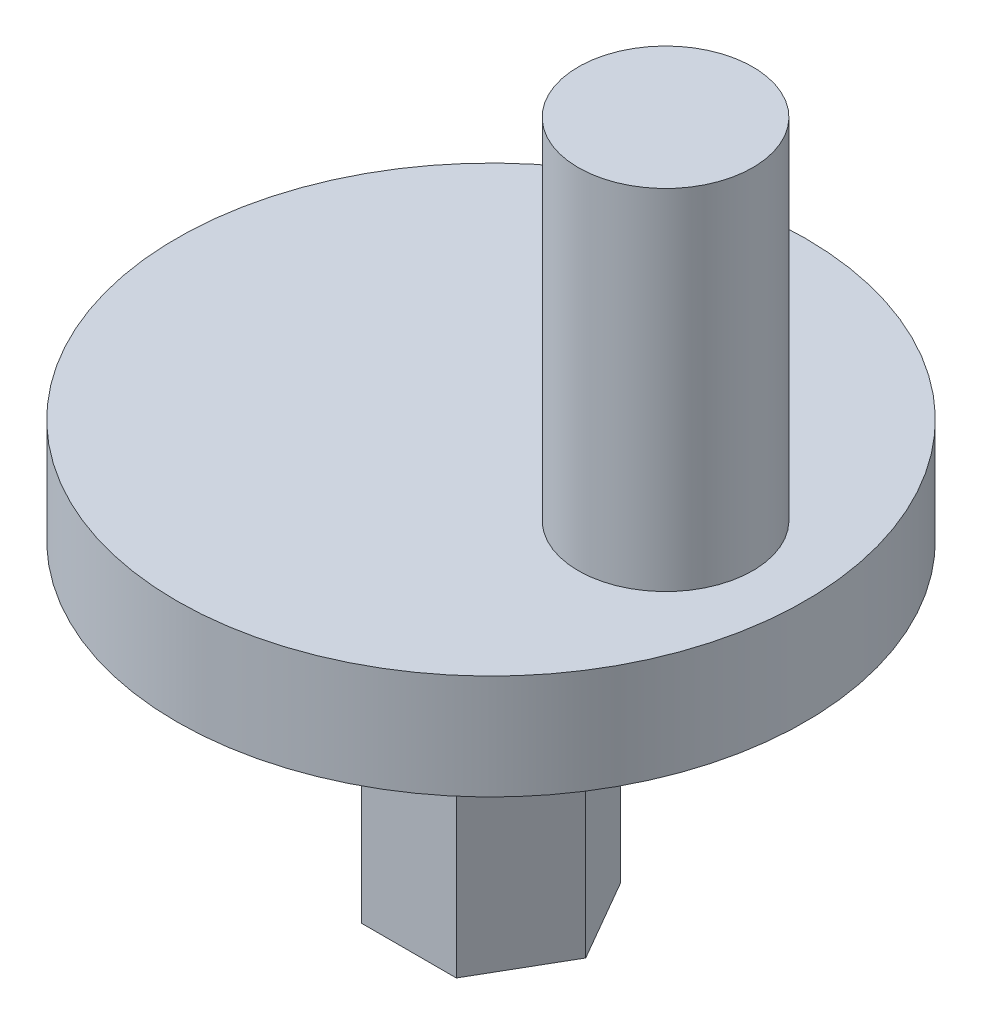
ISO-10303-21;
HEADER;
FILE_DESCRIPTION(('STEP AP214'),'2;1');
FILE_NAME('part.step','',(''),(''),'','','');
FILE_SCHEMA(('AUTOMOTIVE_DESIGN { 1 0 10303 214 1 1 1 1 }'));
ENDSEC;
DATA;
#1=APPLICATION_CONTEXT('core data for automotive mechanical design processes');
#2=APPLICATION_PROTOCOL_DEFINITION('international standard','automotive_design',2000,#1);
#3=PRODUCT_CONTEXT('',#1,'mechanical');
#4=PRODUCT('Part','Part','',(#3));
#5=PRODUCT_RELATED_PRODUCT_CATEGORY('part','',(#4));
#6=PRODUCT_DEFINITION_FORMATION('','',#4);
#7=PRODUCT_DEFINITION_CONTEXT('part definition',#1,'design');
#8=PRODUCT_DEFINITION('design','',#6,#7);
#9=PRODUCT_DEFINITION_SHAPE('','',#8);
#10=(LENGTH_UNIT() NAMED_UNIT(*) SI_UNIT(.MILLI.,.METRE.));
#11=(NAMED_UNIT(*) PLANE_ANGLE_UNIT() SI_UNIT($,.RADIAN.));
#12=(NAMED_UNIT(*) SI_UNIT($,.STERADIAN.) SOLID_ANGLE_UNIT());
#13=UNCERTAINTY_MEASURE_WITH_UNIT(LENGTH_MEASURE(1.E-05),#10,'distance_accuracy_value','');
#14=(GEOMETRIC_REPRESENTATION_CONTEXT(3) GLOBAL_UNCERTAINTY_ASSIGNED_CONTEXT((#13)) GLOBAL_UNIT_ASSIGNED_CONTEXT((#10,
#11,#12)) REPRESENTATION_CONTEXT('',''));
#15=CARTESIAN_POINT('',(0.,0.,0.));
#16=DIRECTION('',(0.,0.,1.));
#17=DIRECTION('',(1.,0.,0.));
#18=AXIS2_PLACEMENT_3D('',#15,#16,#17);
#19=CARTESIAN_POINT('',(0.,0.,0.));
#20=DIRECTION('',(0.,1.,0.));
#21=DIRECTION('',(0.,0.,1.));
#22=AXIS2_PLACEMENT_3D('',#19,#20,#21);
#23=PLANE('',#22);
#24=CARTESIAN_POINT('',(0.,0.,0.));
#25=DIRECTION('',(0.,1.,0.));
#26=DIRECTION('',(0.,0.,1.));
#27=AXIS2_PLACEMENT_3D('',#24,#25,#26);
#28=CIRCLE('',#27,9.);
#29=CARTESIAN_POINT('',(0.,0.,9.));
#30=VERTEX_POINT('',#29);
#31=EDGE_CURVE('E49',#30,#30,#28,.T.);
#32=ORIENTED_EDGE('',*,*,#31,.F.);
#33=EDGE_LOOP('',(#32));
#34=FACE_BOUND('',#33,.T.);
#35=DIRECTION('',(0.5,0.,0.866025403784439));
#36=VECTOR('',#35,1.);
#37=CARTESIAN_POINT('',(1.35677313259562,0.,-2.35));
#38=LINE('',#37,#36);
#39=CARTESIAN_POINT('',(1.35677313259562,0.,-2.35));
#40=VERTEX_POINT('',#39);
#41=CARTESIAN_POINT('',(2.71354626519124,0.,0.));
#42=VERTEX_POINT('',#41);
#43=EDGE_CURVE('E61',#40,#42,#38,.T.);
#44=ORIENTED_EDGE('',*,*,#43,.F.);
#45=DIRECTION('',(1.,0.,0.));
#46=VECTOR('',#45,1.);
#47=CARTESIAN_POINT('',(-1.35677313259562,0.,-2.35));
#48=LINE('',#47,#46);
#49=CARTESIAN_POINT('',(-1.35677313259562,0.,-2.35));
#50=VERTEX_POINT('',#49);
#51=EDGE_CURVE('E65',#50,#40,#48,.T.);
#52=ORIENTED_EDGE('',*,*,#51,.F.);
#53=DIRECTION('',(0.5,0.,-0.866025403784439));
#54=VECTOR('',#53,1.);
#55=CARTESIAN_POINT('',(-2.71354626519124,0.,0.));
#56=LINE('',#55,#54);
#57=CARTESIAN_POINT('',(-2.71354626519124,0.,0.));
#58=VERTEX_POINT('',#57);
#59=EDGE_CURVE('E255',#58,#50,#56,.T.);
#60=ORIENTED_EDGE('',*,*,#59,.F.);
#61=DIRECTION('',(-0.5,0.,-0.866025403784439));
#62=VECTOR('',#61,1.);
#63=CARTESIAN_POINT('',(-1.35677313259562,0.,2.35));
#64=LINE('',#63,#62);
#65=CARTESIAN_POINT('',(-1.35677313259562,0.,2.35));
#66=VERTEX_POINT('',#65);
#67=EDGE_CURVE('E275',#66,#58,#64,.T.);
#68=ORIENTED_EDGE('',*,*,#67,.F.);
#69=DIRECTION('',(-1.,0.,0.));
#70=VECTOR('',#69,1.);
#71=CARTESIAN_POINT('',(1.35677313259562,0.,2.35));
#72=LINE('',#71,#70);
#73=CARTESIAN_POINT('',(1.35677313259562,0.,2.35));
#74=VERTEX_POINT('',#73);
#75=EDGE_CURVE('E278',#74,#66,#72,.T.);
#76=ORIENTED_EDGE('',*,*,#75,.F.);
#77=DIRECTION('',(-0.5,0.,0.866025403784438));
#78=VECTOR('',#77,1.);
#79=CARTESIAN_POINT('',(2.71354626519124,0.,0.));
#80=LINE('',#79,#78);
#81=EDGE_CURVE('E280',#42,#74,#80,.T.);
#82=ORIENTED_EDGE('',*,*,#81,.F.);
#83=EDGE_LOOP('',(#44,#52,#60,#68,#76,#82));
#84=FACE_BOUND('',#83,.T.);
#85=ADVANCED_FACE('F45',(#34,#84),#23,.F.);
#86=CARTESIAN_POINT('',(0.,3.,0.));
#87=DIRECTION('',(0.,-1.,0.));
#88=DIRECTION('',(0.,0.,-1.));
#89=AXIS2_PLACEMENT_3D('',#86,#87,#88);
#90=CYLINDRICAL_SURFACE('',#89,9.);
#91=CARTESIAN_POINT('',(0.,3.,0.));
#92=DIRECTION('',(0.,1.,0.));
#93=DIRECTION('',(0.,0.,1.));
#94=AXIS2_PLACEMENT_3D('',#91,#92,#93);
#95=CIRCLE('',#94,9.);
#96=CARTESIAN_POINT('',(0.,3.,9.));
#97=VERTEX_POINT('',#96);
#98=EDGE_CURVE('E11',#97,#97,#95,.T.);
#99=ORIENTED_EDGE('',*,*,#98,.F.);
#100=EDGE_LOOP('',(#99));
#101=FACE_BOUND('',#100,.T.);
#102=ORIENTED_EDGE('',*,*,#31,.T.);
#103=EDGE_LOOP('',(#102));
#104=FACE_BOUND('',#103,.T.);
#105=ADVANCED_FACE('F47',(#101,#104),#90,.T.);
#106=CARTESIAN_POINT('',(0.,3.,0.));
#107=DIRECTION('',(0.,1.,0.));
#108=DIRECTION('',(0.,0.,1.));
#109=AXIS2_PLACEMENT_3D('',#106,#107,#108);
#110=PLANE('',#109);
#111=CARTESIAN_POINT('',(5.,3.,0.));
#112=DIRECTION('',(0.,1.,0.));
#113=DIRECTION('',(0.,0.,1.));
#114=AXIS2_PLACEMENT_3D('',#111,#112,#113);
#115=CIRCLE('',#114,2.5);
#116=CARTESIAN_POINT('',(5.,3.,2.5));
#117=VERTEX_POINT('',#116);
#118=EDGE_CURVE('E122',#117,#117,#115,.T.);
#119=ORIENTED_EDGE('',*,*,#118,.F.);
#120=EDGE_LOOP('',(#119));
#121=FACE_BOUND('',#120,.T.);
#122=ORIENTED_EDGE('',*,*,#98,.T.);
#123=EDGE_LOOP('',(#122));
#124=FACE_BOUND('',#123,.T.);
#125=ADVANCED_FACE('F148',(#121,#124),#110,.T.);
#126=CARTESIAN_POINT('',(5.,13.,0.));
#127=DIRECTION('',(0.,-1.,0.));
#128=DIRECTION('',(0.,0.,-1.));
#129=AXIS2_PLACEMENT_3D('',#126,#127,#128);
#130=CYLINDRICAL_SURFACE('',#129,2.5);
#131=CARTESIAN_POINT('',(5.,13.,0.));
#132=DIRECTION('',(0.,1.,0.));
#133=DIRECTION('',(0.,0.,1.));
#134=AXIS2_PLACEMENT_3D('',#131,#132,#133);
#135=CIRCLE('',#134,2.5);
#136=CARTESIAN_POINT('',(5.,13.,2.5));
#137=VERTEX_POINT('',#136);
#138=EDGE_CURVE('E127',#137,#137,#135,.T.);
#139=ORIENTED_EDGE('',*,*,#138,.F.);
#140=EDGE_LOOP('',(#139));
#141=FACE_BOUND('',#140,.T.);
#142=ORIENTED_EDGE('',*,*,#118,.T.);
#143=EDGE_LOOP('',(#142));
#144=FACE_BOUND('',#143,.T.);
#145=ADVANCED_FACE('F153',(#141,#144),#130,.T.);
#146=CARTESIAN_POINT('',(5.,13.,0.));
#147=DIRECTION('',(0.,1.,0.));
#148=DIRECTION('',(0.,0.,1.));
#149=AXIS2_PLACEMENT_3D('',#146,#147,#148);
#150=PLANE('',#149);
#151=ORIENTED_EDGE('',*,*,#138,.T.);
#152=EDGE_LOOP('',(#151));
#153=FACE_BOUND('',#152,.T.);
#154=ADVANCED_FACE('F157',(#153),#150,.T.);
#155=CARTESIAN_POINT('',(1.35677313259562,-9.,-2.35));
#156=DIRECTION('',(-0.866025403784439,0.,0.5));
#157=DIRECTION('',(0.5,0.,0.866025403784439));
#158=AXIS2_PLACEMENT_3D('',#155,#156,#157);
#159=PLANE('',#158);
#160=ORIENTED_EDGE('',*,*,#43,.T.);
#161=DIRECTION('',(0.,1.,0.));
#162=VECTOR('',#161,1.);
#163=CARTESIAN_POINT('',(2.71354626519124,-9.,0.));
#164=LINE('',#163,#162);
#165=CARTESIAN_POINT('',(2.71354626519124,-9.,0.));
#166=VERTEX_POINT('',#165);
#167=EDGE_CURVE('E102',#166,#42,#164,.T.);
#168=ORIENTED_EDGE('',*,*,#167,.F.);
#169=DIRECTION('',(0.5,0.,0.866025403784439));
#170=VECTOR('',#169,1.);
#171=CARTESIAN_POINT('',(1.35677313259562,-9.,-2.35));
#172=LINE('',#171,#170);
#173=CARTESIAN_POINT('',(1.35677313259562,-9.,-2.35));
#174=VERTEX_POINT('',#173);
#175=EDGE_CURVE('E109',#174,#166,#172,.T.);
#176=ORIENTED_EDGE('',*,*,#175,.F.);
#177=DIRECTION('',(0.,1.,0.));
#178=VECTOR('',#177,1.);
#179=CARTESIAN_POINT('',(1.35677313259562,-9.,-2.35));
#180=LINE('',#179,#178);
#181=EDGE_CURVE('E251',#174,#40,#180,.T.);
#182=ORIENTED_EDGE('',*,*,#181,.T.);
#183=EDGE_LOOP('',(#160,#168,#176,#182));
#184=FACE_BOUND('',#183,.T.);
#185=ADVANCED_FACE('F120',(#184),#159,.F.);
#186=CARTESIAN_POINT('',(2.71354626519124,-9.,0.));
#187=DIRECTION('',(-0.866025403784439,0.,-0.5));
#188=DIRECTION('',(-0.5,0.,0.866025403784439));
#189=AXIS2_PLACEMENT_3D('',#186,#187,#188);
#190=PLANE('',#189);
#191=ORIENTED_EDGE('',*,*,#81,.T.);
#192=DIRECTION('',(0.,1.,0.));
#193=VECTOR('',#192,1.);
#194=CARTESIAN_POINT('',(1.35677313259562,-9.,2.35));
#195=LINE('',#194,#193);
#196=CARTESIAN_POINT('',(1.35677313259562,-9.,2.35));
#197=VERTEX_POINT('',#196);
#198=EDGE_CURVE('E104',#197,#74,#195,.T.);
#199=ORIENTED_EDGE('',*,*,#198,.F.);
#200=DIRECTION('',(-0.5,0.,0.866025403784438));
#201=VECTOR('',#200,1.);
#202=CARTESIAN_POINT('',(2.71354626519124,-9.,0.));
#203=LINE('',#202,#201);
#204=EDGE_CURVE('E97',#166,#197,#203,.T.);
#205=ORIENTED_EDGE('',*,*,#204,.F.);
#206=ORIENTED_EDGE('',*,*,#167,.T.);
#207=EDGE_LOOP('',(#191,#199,#205,#206));
#208=FACE_BOUND('',#207,.T.);
#209=ADVANCED_FACE('F100',(#208),#190,.F.);
#210=CARTESIAN_POINT('',(1.35677313259562,-9.,2.35));
#211=DIRECTION('',(0.,0.,-1.));
#212=DIRECTION('',(-1.,0.,0.));
#213=AXIS2_PLACEMENT_3D('',#210,#211,#212);
#214=PLANE('',#213);
#215=ORIENTED_EDGE('',*,*,#75,.T.);
#216=DIRECTION('',(0.,1.,0.));
#217=VECTOR('',#216,1.);
#218=CARTESIAN_POINT('',(-1.35677313259562,-9.,2.35));
#219=LINE('',#218,#217);
#220=CARTESIAN_POINT('',(-1.35677313259562,-9.,2.35));
#221=VERTEX_POINT('',#220);
#222=EDGE_CURVE('E129',#221,#66,#219,.T.);
#223=ORIENTED_EDGE('',*,*,#222,.F.);
#224=DIRECTION('',(-1.,0.,0.));
#225=VECTOR('',#224,1.);
#226=CARTESIAN_POINT('',(1.35677313259562,-9.,2.35));
#227=LINE('',#226,#225);
#228=EDGE_CURVE('E108',#197,#221,#227,.T.);
#229=ORIENTED_EDGE('',*,*,#228,.F.);
#230=ORIENTED_EDGE('',*,*,#198,.T.);
#231=EDGE_LOOP('',(#215,#223,#229,#230));
#232=FACE_BOUND('',#231,.T.);
#233=ADVANCED_FACE('F163',(#232),#214,.F.);
#234=CARTESIAN_POINT('',(-1.35677313259562,-9.,2.35));
#235=DIRECTION('',(0.866025403784439,0.,-0.5));
#236=DIRECTION('',(-0.5,0.,-0.866025403784439));
#237=AXIS2_PLACEMENT_3D('',#234,#235,#236);
#238=PLANE('',#237);
#239=ORIENTED_EDGE('',*,*,#67,.T.);
#240=DIRECTION('',(0.,1.,0.));
#241=VECTOR('',#240,1.);
#242=CARTESIAN_POINT('',(-2.71354626519124,-9.,0.));
#243=LINE('',#242,#241);
#244=CARTESIAN_POINT('',(-2.71354626519124,-9.,0.));
#245=VERTEX_POINT('',#244);
#246=EDGE_CURVE('E261',#245,#58,#243,.T.);
#247=ORIENTED_EDGE('',*,*,#246,.F.);
#248=DIRECTION('',(-0.5,0.,-0.866025403784439));
#249=VECTOR('',#248,1.);
#250=CARTESIAN_POINT('',(-1.35677313259562,-9.,2.35));
#251=LINE('',#250,#249);
#252=EDGE_CURVE('E276',#221,#245,#251,.T.);
#253=ORIENTED_EDGE('',*,*,#252,.F.);
#254=ORIENTED_EDGE('',*,*,#222,.T.);
#255=EDGE_LOOP('',(#239,#247,#253,#254));
#256=FACE_BOUND('',#255,.T.);
#257=ADVANCED_FACE('F166',(#256),#238,.F.);
#258=CARTESIAN_POINT('',(-2.71354626519124,-9.,0.));
#259=DIRECTION('',(0.866025403784439,0.,0.5));
#260=DIRECTION('',(0.5,0.,-0.866025403784439));
#261=AXIS2_PLACEMENT_3D('',#258,#259,#260);
#262=PLANE('',#261);
#263=ORIENTED_EDGE('',*,*,#59,.T.);
#264=DIRECTION('',(0.,1.,0.));
#265=VECTOR('',#264,1.);
#266=CARTESIAN_POINT('',(-1.35677313259562,-9.,-2.35));
#267=LINE('',#266,#265);
#268=CARTESIAN_POINT('',(-1.35677313259562,-9.,-2.35));
#269=VERTEX_POINT('',#268);
#270=EDGE_CURVE('E253',#269,#50,#267,.T.);
#271=ORIENTED_EDGE('',*,*,#270,.F.);
#272=DIRECTION('',(0.5,0.,-0.866025403784439));
#273=VECTOR('',#272,1.);
#274=CARTESIAN_POINT('',(-2.71354626519124,-9.,0.));
#275=LINE('',#274,#273);
#276=EDGE_CURVE('E263',#245,#269,#275,.T.);
#277=ORIENTED_EDGE('',*,*,#276,.F.);
#278=ORIENTED_EDGE('',*,*,#246,.T.);
#279=EDGE_LOOP('',(#263,#271,#277,#278));
#280=FACE_BOUND('',#279,.T.);
#281=ADVANCED_FACE('F170',(#280),#262,.F.);
#282=CARTESIAN_POINT('',(-1.35677313259562,-9.,-2.35));
#283=DIRECTION('',(0.,0.,1.));
#284=DIRECTION('',(1.,0.,0.));
#285=AXIS2_PLACEMENT_3D('',#282,#283,#284);
#286=PLANE('',#285);
#287=ORIENTED_EDGE('',*,*,#51,.T.);
#288=ORIENTED_EDGE('',*,*,#181,.F.);
#289=DIRECTION('',(1.,0.,0.));
#290=VECTOR('',#289,1.);
#291=CARTESIAN_POINT('',(-1.35677313259562,-9.,-2.35));
#292=LINE('',#291,#290);
#293=EDGE_CURVE('E114',#269,#174,#292,.T.);
#294=ORIENTED_EDGE('',*,*,#293,.F.);
#295=ORIENTED_EDGE('',*,*,#270,.T.);
#296=EDGE_LOOP('',(#287,#288,#294,#295));
#297=FACE_BOUND('',#296,.T.);
#298=ADVANCED_FACE('F174',(#297),#286,.F.);
#299=CARTESIAN_POINT('',(0.,-9.,0.));
#300=DIRECTION('',(0.,-1.,0.));
#301=DIRECTION('',(0.,0.,-1.));
#302=AXIS2_PLACEMENT_3D('',#299,#300,#301);
#303=PLANE('',#302);
#304=ORIENTED_EDGE('',*,*,#175,.T.);
#305=ORIENTED_EDGE('',*,*,#204,.T.);
#306=ORIENTED_EDGE('',*,*,#228,.T.);
#307=ORIENTED_EDGE('',*,*,#252,.T.);
#308=ORIENTED_EDGE('',*,*,#276,.T.);
#309=ORIENTED_EDGE('',*,*,#293,.T.);
#310=EDGE_LOOP('',(#304,#305,#306,#307,#308,#309));
#311=FACE_BOUND('',#310,.T.);
#312=ADVANCED_FACE('F112',(#311),#303,.T.);
#313=CLOSED_SHELL('',(#85,#105,#125,#145,#154,#185,#209,#233,#257,#281,#298,#312));
#314=MANIFOLD_SOLID_BREP('B2',#313);
#315=ADVANCED_BREP_SHAPE_REPRESENTATION('',(#18,#314),#14);
#316=SHAPE_DEFINITION_REPRESENTATION(#9,#315);
ENDSEC;
END-ISO-10303-21;
